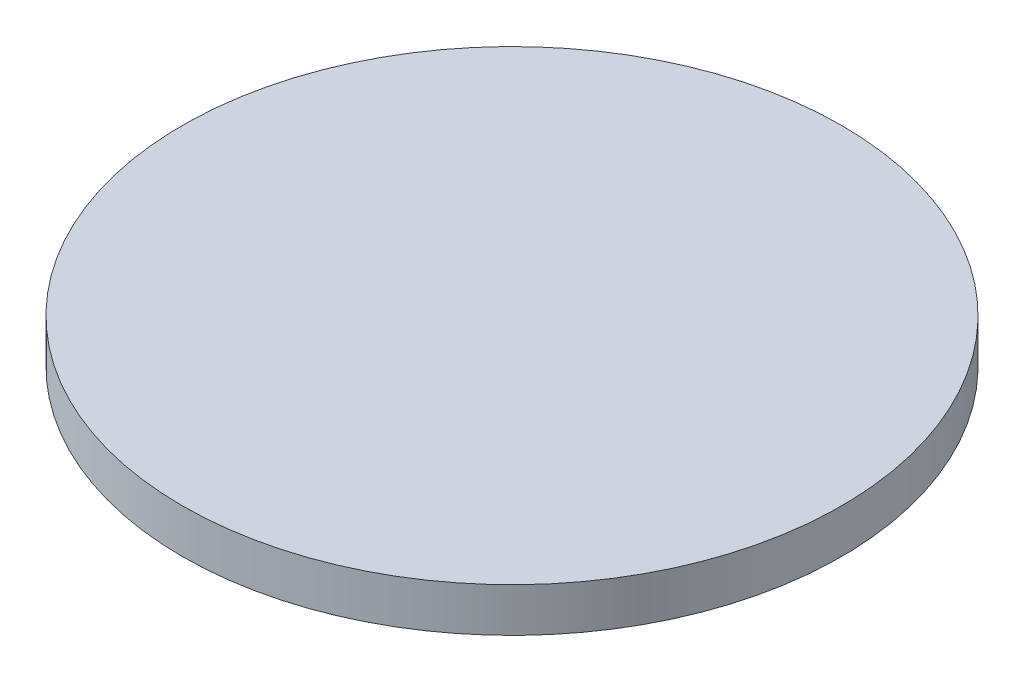
ISO-10303-21;
HEADER;
FILE_DESCRIPTION(('STEP AP214'),'2;1');
FILE_NAME('part.step','',(''),(''),'','','');
FILE_SCHEMA(('AUTOMOTIVE_DESIGN { 1 0 10303 214 1 1 1 1 }'));
ENDSEC;
DATA;
#1=APPLICATION_CONTEXT('core data for automotive mechanical design processes');
#2=APPLICATION_PROTOCOL_DEFINITION('international standard','automotive_design',2000,#1);
#3=PRODUCT_CONTEXT('',#1,'mechanical');
#4=PRODUCT('Part','Part','',(#3));
#5=PRODUCT_RELATED_PRODUCT_CATEGORY('part','',(#4));
#6=PRODUCT_DEFINITION_FORMATION('','',#4);
#7=PRODUCT_DEFINITION_CONTEXT('part definition',#1,'design');
#8=PRODUCT_DEFINITION('design','',#6,#7);
#9=PRODUCT_DEFINITION_SHAPE('','',#8);
#10=(LENGTH_UNIT() NAMED_UNIT(*) SI_UNIT(.MILLI.,.METRE.));
#11=(NAMED_UNIT(*) PLANE_ANGLE_UNIT() SI_UNIT($,.RADIAN.));
#12=(NAMED_UNIT(*) SI_UNIT($,.STERADIAN.) SOLID_ANGLE_UNIT());
#13=UNCERTAINTY_MEASURE_WITH_UNIT(LENGTH_MEASURE(1.E-05),#10,'distance_accuracy_value','');
#14=(GEOMETRIC_REPRESENTATION_CONTEXT(3) GLOBAL_UNCERTAINTY_ASSIGNED_CONTEXT((#13)) GLOBAL_UNIT_ASSIGNED_CONTEXT((#10,
#11,#12)) REPRESENTATION_CONTEXT('',''));
#15=CARTESIAN_POINT('',(0.,0.,0.));
#16=DIRECTION('',(0.,0.,1.));
#17=DIRECTION('',(1.,0.,0.));
#18=AXIS2_PLACEMENT_3D('',#15,#16,#17);
#19=CARTESIAN_POINT('',(0.,10.,0.));
#20=DIRECTION('',(0.,-1.,0.));
#21=DIRECTION('',(0.,0.,-1.));
#22=AXIS2_PLACEMENT_3D('',#19,#20,#21);
#23=CYLINDRICAL_SURFACE('',#22,75.);
#24=CARTESIAN_POINT('',(0.,10.,0.));
#25=DIRECTION('',(0.,1.,0.));
#26=DIRECTION('',(0.,0.,1.));
#27=AXIS2_PLACEMENT_3D('',#24,#25,#26);
#28=CIRCLE('',#27,75.);
#29=CARTESIAN_POINT('',(0.,10.,75.));
#30=VERTEX_POINT('',#29);
#31=EDGE_CURVE('E10',#30,#30,#28,.T.);
#32=ORIENTED_EDGE('',*,*,#31,.F.);
#33=EDGE_LOOP('',(#32));
#34=FACE_BOUND('',#33,.T.);
#35=CARTESIAN_POINT('',(0.,0.,0.));
#36=DIRECTION('',(0.,1.,0.));
#37=DIRECTION('',(0.,0.,1.));
#38=AXIS2_PLACEMENT_3D('',#35,#36,#37);
#39=CIRCLE('',#38,75.);
#40=CARTESIAN_POINT('',(0.,0.,75.));
#41=VERTEX_POINT('',#40);
#42=EDGE_CURVE('E32',#41,#41,#39,.T.);
#43=ORIENTED_EDGE('',*,*,#42,.T.);
#44=EDGE_LOOP('',(#43));
#45=FACE_BOUND('',#44,.T.);
#46=ADVANCED_FACE('F29',(#34,#45),#23,.T.);
#47=CARTESIAN_POINT('',(0.,10.,0.));
#48=DIRECTION('',(0.,1.,0.));
#49=DIRECTION('',(0.,0.,1.));
#50=AXIS2_PLACEMENT_3D('',#47,#48,#49);
#51=PLANE('',#50);
#52=ORIENTED_EDGE('',*,*,#31,.T.);
#53=EDGE_LOOP('',(#52));
#54=FACE_BOUND('',#53,.T.);
#55=ADVANCED_FACE('F44',(#54),#51,.T.);
#56=CARTESIAN_POINT('',(0.,0.,0.));
#57=DIRECTION('',(0.,1.,0.));
#58=DIRECTION('',(0.,0.,1.));
#59=AXIS2_PLACEMENT_3D('',#56,#57,#58);
#60=PLANE('',#59);
#61=ORIENTED_EDGE('',*,*,#42,.F.);
#62=EDGE_LOOP('',(#61));
#63=FACE_BOUND('',#62,.T.);
#64=ADVANCED_FACE('F42',(#63),#60,.F.);
#65=CLOSED_SHELL('',(#46,#55,#64));
#66=MANIFOLD_SOLID_BREP('B2',#65);
#67=ADVANCED_BREP_SHAPE_REPRESENTATION('',(#18,#66),#14);
#68=SHAPE_DEFINITION_REPRESENTATION(#9,#67);
ENDSEC;
END-ISO-10303-21;
